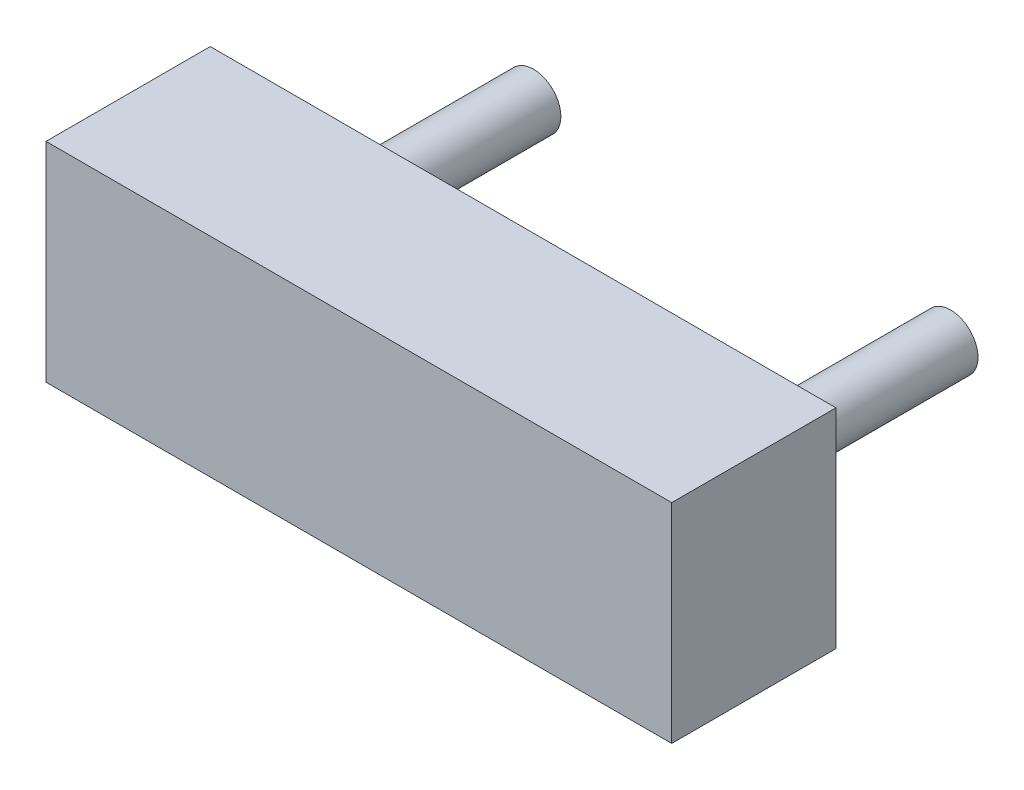
ISO-10303-21;
HEADER;
FILE_DESCRIPTION(('STEP AP214'),'2;1');
FILE_NAME('part.step','',(''),(''),'','','');
FILE_SCHEMA(('AUTOMOTIVE_DESIGN { 1 0 10303 214 1 1 1 1 }'));
ENDSEC;
DATA;
#1=APPLICATION_CONTEXT('core data for automotive mechanical design processes');
#2=APPLICATION_PROTOCOL_DEFINITION('international standard','automotive_design',2000,#1);
#3=PRODUCT_CONTEXT('',#1,'mechanical');
#4=PRODUCT('Part','Part','',(#3));
#5=PRODUCT_RELATED_PRODUCT_CATEGORY('part','',(#4));
#6=PRODUCT_DEFINITION_FORMATION('','',#4);
#7=PRODUCT_DEFINITION_CONTEXT('part definition',#1,'design');
#8=PRODUCT_DEFINITION('design','',#6,#7);
#9=PRODUCT_DEFINITION_SHAPE('','',#8);
#10=(LENGTH_UNIT() NAMED_UNIT(*) SI_UNIT(.MILLI.,.METRE.));
#11=(NAMED_UNIT(*) PLANE_ANGLE_UNIT() SI_UNIT($,.RADIAN.));
#12=(NAMED_UNIT(*) SI_UNIT($,.STERADIAN.) SOLID_ANGLE_UNIT());
#13=UNCERTAINTY_MEASURE_WITH_UNIT(LENGTH_MEASURE(1.E-05),#10,'distance_accuracy_value','');
#14=(GEOMETRIC_REPRESENTATION_CONTEXT(3) GLOBAL_UNCERTAINTY_ASSIGNED_CONTEXT((#13)) GLOBAL_UNIT_ASSIGNED_CONTEXT((#10,
#11,#12)) REPRESENTATION_CONTEXT('',''));
#15=CARTESIAN_POINT('',(0.,0.,0.));
#16=DIRECTION('',(0.,0.,1.));
#17=DIRECTION('',(1.,0.,0.));
#18=AXIS2_PLACEMENT_3D('',#15,#16,#17);
#19=CARTESIAN_POINT('',(1.905,0.,-2.));
#20=DIRECTION('',(0.,0.,1.));
#21=DIRECTION('',(1.,0.,0.));
#22=AXIS2_PLACEMENT_3D('',#19,#20,#21);
#23=CYLINDRICAL_SURFACE('',#22,0.25);
#24=CARTESIAN_POINT('',(1.905,0.,-2.));
#25=DIRECTION('',(0.,0.,1.));
#26=DIRECTION('',(1.,0.,0.));
#27=AXIS2_PLACEMENT_3D('',#24,#25,#26);
#28=CIRCLE('',#27,0.25);
#29=CARTESIAN_POINT('',(2.155,0.,-2.));
#30=VERTEX_POINT('',#29);
#31=EDGE_CURVE('E11',#30,#30,#28,.T.);
#32=ORIENTED_EDGE('',*,*,#31,.T.);
#33=EDGE_LOOP('',(#32));
#34=FACE_BOUND('',#33,.T.);
#35=CARTESIAN_POINT('',(1.905,0.,0.));
#36=DIRECTION('',(0.,0.,1.));
#37=DIRECTION('',(1.,0.,0.));
#38=AXIS2_PLACEMENT_3D('',#35,#36,#37);
#39=CIRCLE('',#38,0.25);
#40=CARTESIAN_POINT('',(2.155,0.,0.));
#41=VERTEX_POINT('',#40);
#42=EDGE_CURVE('E43',#41,#41,#39,.T.);
#43=ORIENTED_EDGE('',*,*,#42,.F.);
#44=EDGE_LOOP('',(#43));
#45=FACE_BOUND('',#44,.T.);
#46=ADVANCED_FACE('F40',(#34,#45),#23,.T.);
#47=CARTESIAN_POINT('',(1.905,0.,-2.));
#48=DIRECTION('',(0.,0.,1.));
#49=DIRECTION('',(1.,0.,0.));
#50=AXIS2_PLACEMENT_3D('',#47,#48,#49);
#51=PLANE('',#50);
#52=ORIENTED_EDGE('',*,*,#31,.F.);
#53=EDGE_LOOP('',(#52));
#54=FACE_BOUND('',#53,.T.);
#55=ADVANCED_FACE('F55',(#54),#51,.F.);
#56=CARTESIAN_POINT('',(1.905,0.,0.));
#57=DIRECTION('',(0.,0.,1.));
#58=DIRECTION('',(1.,0.,0.));
#59=AXIS2_PLACEMENT_3D('',#56,#57,#58);
#60=PLANE('',#59);
#61=ORIENTED_EDGE('',*,*,#42,.T.);
#62=EDGE_LOOP('',(#61));
#63=FACE_BOUND('',#62,.T.);
#64=ADVANCED_FACE('F52',(#63),#60,.T.);
#65=CLOSED_SHELL('',(#46,#55,#64));
#66=MANIFOLD_SOLID_BREP('B2',#65);
#67=CARTESIAN_POINT('',(-1.905,0.,-2.));
#68=DIRECTION('',(0.,0.,1.));
#69=DIRECTION('',(1.,0.,0.));
#70=AXIS2_PLACEMENT_3D('',#67,#68,#69);
#71=CYLINDRICAL_SURFACE('',#70,0.25);
#72=CARTESIAN_POINT('',(-1.905,0.,-2.));
#73=DIRECTION('',(0.,0.,1.));
#74=DIRECTION('',(1.,0.,0.));
#75=AXIS2_PLACEMENT_3D('',#72,#73,#74);
#76=CIRCLE('',#75,0.25);
#77=CARTESIAN_POINT('',(-1.655,0.,-2.));
#78=VERTEX_POINT('',#77);
#79=EDGE_CURVE('E39',#78,#78,#76,.T.);
#80=ORIENTED_EDGE('',*,*,#79,.T.);
#81=EDGE_LOOP('',(#80));
#82=FACE_BOUND('',#81,.T.);
#83=CARTESIAN_POINT('',(-1.905,0.,0.));
#84=DIRECTION('',(0.,0.,1.));
#85=DIRECTION('',(1.,0.,0.));
#86=AXIS2_PLACEMENT_3D('',#83,#84,#85);
#87=CIRCLE('',#86,0.25);
#88=CARTESIAN_POINT('',(-1.655,0.,0.));
#89=VERTEX_POINT('',#88);
#90=EDGE_CURVE('E93',#89,#89,#87,.T.);
#91=ORIENTED_EDGE('',*,*,#90,.F.);
#92=EDGE_LOOP('',(#91));
#93=FACE_BOUND('',#92,.T.);
#94=ADVANCED_FACE('F90',(#82,#93),#71,.T.);
#95=CARTESIAN_POINT('',(-1.905,0.,-2.));
#96=DIRECTION('',(0.,0.,1.));
#97=DIRECTION('',(1.,0.,0.));
#98=AXIS2_PLACEMENT_3D('',#95,#96,#97);
#99=PLANE('',#98);
#100=ORIENTED_EDGE('',*,*,#79,.F.);
#101=EDGE_LOOP('',(#100));
#102=FACE_BOUND('',#101,.T.);
#103=ADVANCED_FACE('F105',(#102),#99,.F.);
#104=CARTESIAN_POINT('',(-1.905,0.,0.));
#105=DIRECTION('',(0.,0.,1.));
#106=DIRECTION('',(1.,0.,0.));
#107=AXIS2_PLACEMENT_3D('',#104,#105,#106);
#108=PLANE('',#107);
#109=ORIENTED_EDGE('',*,*,#90,.T.);
#110=EDGE_LOOP('',(#109));
#111=FACE_BOUND('',#110,.T.);
#112=ADVANCED_FACE('F102',(#111),#108,.T.);
#113=CLOSED_SHELL('',(#94,#103,#112));
#114=MANIFOLD_SOLID_BREP('B6',#113);
#115=CARTESIAN_POINT('',(2.8575,0.9525,1.5));
#116=DIRECTION('',(0.,-1.,0.));
#117=DIRECTION('',(0.,0.,-1.));
#118=AXIS2_PLACEMENT_3D('',#115,#116,#117);
#119=PLANE('',#118);
#120=DIRECTION('',(-1.,0.,0.));
#121=VECTOR('',#120,1.);
#122=CARTESIAN_POINT('',(2.8575,0.9525,0.));
#123=LINE('',#122,#121);
#124=CARTESIAN_POINT('',(2.8575,0.9525,0.));
#125=VERTEX_POINT('',#124);
#126=CARTESIAN_POINT('',(-2.8575,0.9525,0.));
#127=VERTEX_POINT('',#126);
#128=EDGE_CURVE('E194',#125,#127,#123,.T.);
#129=ORIENTED_EDGE('',*,*,#128,.T.);
#130=DIRECTION('',(0.,0.,-1.));
#131=VECTOR('',#130,1.);
#132=CARTESIAN_POINT('',(-2.8575,0.9525,1.5));
#133=LINE('',#132,#131);
#134=CARTESIAN_POINT('',(-2.8575,0.9525,1.5));
#135=VERTEX_POINT('',#134);
#136=EDGE_CURVE('E88',#135,#127,#133,.T.);
#137=ORIENTED_EDGE('',*,*,#136,.F.);
#138=DIRECTION('',(-1.,0.,0.));
#139=VECTOR('',#138,1.);
#140=CARTESIAN_POINT('',(2.8575,0.9525,1.5));
#141=LINE('',#140,#139);
#142=CARTESIAN_POINT('',(2.8575,0.9525,1.5));
#143=VERTEX_POINT('',#142);
#144=EDGE_CURVE('E182',#143,#135,#141,.T.);
#145=ORIENTED_EDGE('',*,*,#144,.F.);
#146=DIRECTION('',(0.,0.,-1.));
#147=VECTOR('',#146,1.);
#148=CARTESIAN_POINT('',(2.8575,0.9525,1.5));
#149=LINE('',#148,#147);
#150=EDGE_CURVE('E190',#143,#125,#149,.T.);
#151=ORIENTED_EDGE('',*,*,#150,.T.);
#152=EDGE_LOOP('',(#129,#137,#145,#151));
#153=FACE_BOUND('',#152,.T.);
#154=ADVANCED_FACE('F131',(#153),#119,.F.);
#155=CARTESIAN_POINT('',(-2.8575,0.9525,1.5));
#156=DIRECTION('',(1.,0.,0.));
#157=DIRECTION('',(0.,0.,-1.));
#158=AXIS2_PLACEMENT_3D('',#155,#156,#157);
#159=PLANE('',#158);
#160=DIRECTION('',(0.,-1.,0.));
#161=VECTOR('',#160,1.);
#162=CARTESIAN_POINT('',(-2.8575,0.9525,0.));
#163=LINE('',#162,#161);
#164=CARTESIAN_POINT('',(-2.8575,-0.9525,0.));
#165=VERTEX_POINT('',#164);
#166=EDGE_CURVE('E186',#127,#165,#163,.T.);
#167=ORIENTED_EDGE('',*,*,#166,.T.);
#168=DIRECTION('',(0.,0.,-1.));
#169=VECTOR('',#168,1.);
#170=CARTESIAN_POINT('',(-2.8575,-0.9525,1.5));
#171=LINE('',#170,#169);
#172=CARTESIAN_POINT('',(-2.8575,-0.9525,1.5));
#173=VERTEX_POINT('',#172);
#174=EDGE_CURVE('E139',#173,#165,#171,.T.);
#175=ORIENTED_EDGE('',*,*,#174,.F.);
#176=DIRECTION('',(0.,-1.,0.));
#177=VECTOR('',#176,1.);
#178=CARTESIAN_POINT('',(-2.8575,0.9525,1.5));
#179=LINE('',#178,#177);
#180=EDGE_CURVE('E177',#135,#173,#179,.T.);
#181=ORIENTED_EDGE('',*,*,#180,.F.);
#182=ORIENTED_EDGE('',*,*,#136,.T.);
#183=EDGE_LOOP('',(#167,#175,#181,#182));
#184=FACE_BOUND('',#183,.T.);
#185=ADVANCED_FACE('F185',(#184),#159,.F.);
#186=CARTESIAN_POINT('',(-2.8575,-0.9525,1.5));
#187=DIRECTION('',(0.,1.,0.));
#188=DIRECTION('',(0.,0.,1.));
#189=AXIS2_PLACEMENT_3D('',#186,#187,#188);
#190=PLANE('',#189);
#191=DIRECTION('',(1.,0.,0.));
#192=VECTOR('',#191,1.);
#193=CARTESIAN_POINT('',(-2.8575,-0.9525,0.));
#194=LINE('',#193,#192);
#195=CARTESIAN_POINT('',(2.8575,-0.9525,0.));
#196=VERTEX_POINT('',#195);
#197=EDGE_CURVE('E164',#165,#196,#194,.T.);
#198=ORIENTED_EDGE('',*,*,#197,.T.);
#199=DIRECTION('',(0.,0.,-1.));
#200=VECTOR('',#199,1.);
#201=CARTESIAN_POINT('',(2.8575,-0.9525,1.5));
#202=LINE('',#201,#200);
#203=CARTESIAN_POINT('',(2.8575,-0.9525,1.5));
#204=VERTEX_POINT('',#203);
#205=EDGE_CURVE('E187',#204,#196,#202,.T.);
#206=ORIENTED_EDGE('',*,*,#205,.F.);
#207=DIRECTION('',(1.,0.,0.));
#208=VECTOR('',#207,1.);
#209=CARTESIAN_POINT('',(-2.8575,-0.9525,1.5));
#210=LINE('',#209,#208);
#211=EDGE_CURVE('E180',#173,#204,#210,.T.);
#212=ORIENTED_EDGE('',*,*,#211,.F.);
#213=ORIENTED_EDGE('',*,*,#174,.T.);
#214=EDGE_LOOP('',(#198,#206,#212,#213));
#215=FACE_BOUND('',#214,.T.);
#216=ADVANCED_FACE('F188',(#215),#190,.F.);
#217=CARTESIAN_POINT('',(2.8575,-0.9525,1.5));
#218=DIRECTION('',(-1.,0.,0.));
#219=DIRECTION('',(0.,0.,1.));
#220=AXIS2_PLACEMENT_3D('',#217,#218,#219);
#221=PLANE('',#220);
#222=DIRECTION('',(0.,1.,0.));
#223=VECTOR('',#222,1.);
#224=CARTESIAN_POINT('',(2.8575,-0.9525,0.));
#225=LINE('',#224,#223);
#226=EDGE_CURVE('E170',#196,#125,#225,.T.);
#227=ORIENTED_EDGE('',*,*,#226,.T.);
#228=ORIENTED_EDGE('',*,*,#150,.F.);
#229=DIRECTION('',(0.,1.,0.));
#230=VECTOR('',#229,1.);
#231=CARTESIAN_POINT('',(2.8575,-0.9525,1.5));
#232=LINE('',#231,#230);
#233=EDGE_CURVE('E147',#204,#143,#232,.T.);
#234=ORIENTED_EDGE('',*,*,#233,.F.);
#235=ORIENTED_EDGE('',*,*,#205,.T.);
#236=EDGE_LOOP('',(#227,#228,#234,#235));
#237=FACE_BOUND('',#236,.T.);
#238=ADVANCED_FACE('F201',(#237),#221,.F.);
#239=CARTESIAN_POINT('',(0.,0.,1.5));
#240=DIRECTION('',(0.,0.,1.));
#241=DIRECTION('',(1.,0.,0.));
#242=AXIS2_PLACEMENT_3D('',#239,#240,#241);
#243=PLANE('',#242);
#244=ORIENTED_EDGE('',*,*,#144,.T.);
#245=ORIENTED_EDGE('',*,*,#180,.T.);
#246=ORIENTED_EDGE('',*,*,#211,.T.);
#247=ORIENTED_EDGE('',*,*,#233,.T.);
#248=EDGE_LOOP('',(#244,#245,#246,#247));
#249=FACE_BOUND('',#248,.T.);
#250=ADVANCED_FACE('F178',(#249),#243,.T.);
#251=CARTESIAN_POINT('',(0.,0.,0.));
#252=DIRECTION('',(0.,0.,1.));
#253=DIRECTION('',(1.,0.,0.));
#254=AXIS2_PLACEMENT_3D('',#251,#252,#253);
#255=PLANE('',#254);
#256=ORIENTED_EDGE('',*,*,#128,.F.);
#257=ORIENTED_EDGE('',*,*,#226,.F.);
#258=ORIENTED_EDGE('',*,*,#197,.F.);
#259=ORIENTED_EDGE('',*,*,#166,.F.);
#260=EDGE_LOOP('',(#256,#257,#258,#259));
#261=FACE_BOUND('',#260,.T.);
#262=ADVANCED_FACE('F204',(#261),#255,.F.);
#263=CLOSED_SHELL('',(#154,#185,#216,#238,#250,#262));
#264=MANIFOLD_SOLID_BREP('B34',#263);
#265=ADVANCED_BREP_SHAPE_REPRESENTATION('',(#18,#66,#114,#264),#14);
#266=SHAPE_DEFINITION_REPRESENTATION(#9,#265);
ENDSEC;
END-ISO-10303-21;
